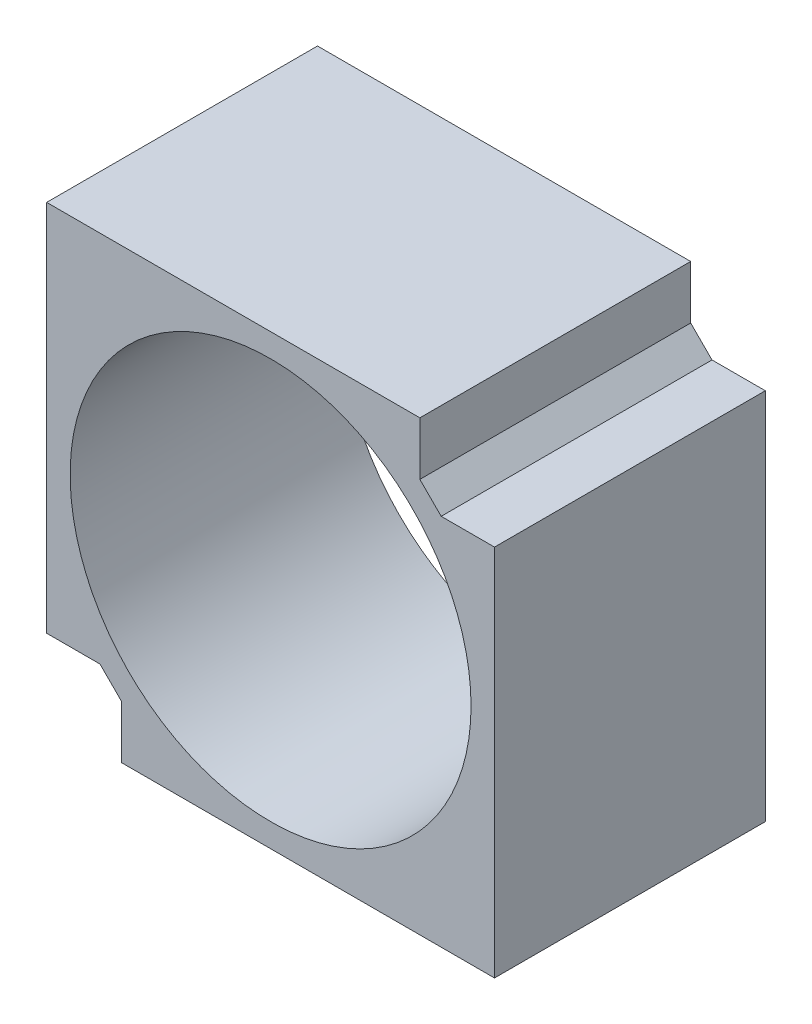
ISO-10303-21;
HEADER;
FILE_DESCRIPTION(('STEP AP214'),'2;1');
FILE_NAME('part.step','',(''),(''),'','','');
FILE_SCHEMA(('AUTOMOTIVE_DESIGN { 1 0 10303 214 1 1 1 1 }'));
ENDSEC;
DATA;
#1=APPLICATION_CONTEXT('core data for automotive mechanical design processes');
#2=APPLICATION_PROTOCOL_DEFINITION('international standard','automotive_design',2000,#1);
#3=PRODUCT_CONTEXT('',#1,'mechanical');
#4=PRODUCT('Part','Part','',(#3));
#5=PRODUCT_RELATED_PRODUCT_CATEGORY('part','',(#4));
#6=PRODUCT_DEFINITION_FORMATION('','',#4);
#7=PRODUCT_DEFINITION_CONTEXT('part definition',#1,'design');
#8=PRODUCT_DEFINITION('design','',#6,#7);
#9=PRODUCT_DEFINITION_SHAPE('','',#8);
#10=(LENGTH_UNIT() NAMED_UNIT(*) SI_UNIT(.MILLI.,.METRE.));
#11=(NAMED_UNIT(*) PLANE_ANGLE_UNIT() SI_UNIT($,.RADIAN.));
#12=(NAMED_UNIT(*) SI_UNIT($,.STERADIAN.) SOLID_ANGLE_UNIT());
#13=UNCERTAINTY_MEASURE_WITH_UNIT(LENGTH_MEASURE(1.E-05),#10,'distance_accuracy_value','');
#14=(GEOMETRIC_REPRESENTATION_CONTEXT(3) GLOBAL_UNCERTAINTY_ASSIGNED_CONTEXT((#13)) GLOBAL_UNIT_ASSIGNED_CONTEXT((#10,
#11,#12)) REPRESENTATION_CONTEXT('',''));
#15=CARTESIAN_POINT('',(0.,0.,0.));
#16=DIRECTION('',(0.,0.,1.));
#17=DIRECTION('',(1.,0.,0.));
#18=AXIS2_PLACEMENT_3D('',#15,#16,#17);
#19=CARTESIAN_POINT('',(-21.,-21.,25.4));
#20=DIRECTION('',(1.,0.,0.));
#21=DIRECTION('',(0.,0.,-1.));
#22=AXIS2_PLACEMENT_3D('',#19,#20,#21);
#23=PLANE('',#22);
#24=DIRECTION('',(0.,-1.,0.));
#25=VECTOR('',#24,1.);
#26=CARTESIAN_POINT('',(-21.,-21.,0.));
#27=LINE('',#26,#25);
#28=CARTESIAN_POINT('',(-21.,21.,0.));
#29=VERTEX_POINT('',#28);
#30=CARTESIAN_POINT('',(-21.,-14.,0.));
#31=VERTEX_POINT('',#30);
#32=EDGE_CURVE('E143',#29,#31,#27,.T.);
#33=ORIENTED_EDGE('',*,*,#32,.T.);
#34=DIRECTION('',(0.,0.,1.));
#35=VECTOR('',#34,1.);
#36=CARTESIAN_POINT('',(-21.,-14.,0.));
#37=LINE('',#36,#35);
#38=CARTESIAN_POINT('',(-21.,-14.,25.4));
#39=VERTEX_POINT('',#38);
#40=EDGE_CURVE('E198',#31,#39,#37,.T.);
#41=ORIENTED_EDGE('',*,*,#40,.T.);
#42=DIRECTION('',(0.,-1.,0.));
#43=VECTOR('',#42,1.);
#44=CARTESIAN_POINT('',(-21.,-21.,25.4));
#45=LINE('',#44,#43);
#46=CARTESIAN_POINT('',(-21.,21.,25.4));
#47=VERTEX_POINT('',#46);
#48=EDGE_CURVE('E165',#47,#39,#45,.T.);
#49=ORIENTED_EDGE('',*,*,#48,.F.);
#50=DIRECTION('',(0.,0.,-1.));
#51=VECTOR('',#50,1.);
#52=CARTESIAN_POINT('',(-21.,21.,25.4));
#53=LINE('',#52,#51);
#54=EDGE_CURVE('E11',#47,#29,#53,.T.);
#55=ORIENTED_EDGE('',*,*,#54,.T.);
#56=EDGE_LOOP('',(#33,#41,#49,#55));
#57=FACE_BOUND('',#56,.T.);
#58=ADVANCED_FACE('F38',(#57),#23,.F.);
#59=CARTESIAN_POINT('',(21.,-21.,25.4));
#60=DIRECTION('',(0.,1.,0.));
#61=DIRECTION('',(-1.,0.,0.));
#62=AXIS2_PLACEMENT_3D('',#59,#60,#61);
#63=PLANE('',#62);
#64=DIRECTION('',(1.,0.,0.));
#65=VECTOR('',#64,1.);
#66=CARTESIAN_POINT('',(21.,-21.,25.4));
#67=LINE('',#66,#65);
#68=CARTESIAN_POINT('',(-14.,-21.,25.4));
#69=VERTEX_POINT('',#68);
#70=CARTESIAN_POINT('',(21.,-21.,25.4));
#71=VERTEX_POINT('',#70);
#72=EDGE_CURVE('E132',#69,#71,#67,.T.);
#73=ORIENTED_EDGE('',*,*,#72,.F.);
#74=DIRECTION('',(0.,0.,1.));
#75=VECTOR('',#74,1.);
#76=CARTESIAN_POINT('',(-14.,-21.,0.));
#77=LINE('',#76,#75);
#78=CARTESIAN_POINT('',(-14.,-21.,0.));
#79=VERTEX_POINT('',#78);
#80=EDGE_CURVE('E118',#79,#69,#77,.T.);
#81=ORIENTED_EDGE('',*,*,#80,.F.);
#82=DIRECTION('',(1.,0.,0.));
#83=VECTOR('',#82,1.);
#84=CARTESIAN_POINT('',(21.,-21.,0.));
#85=LINE('',#84,#83);
#86=CARTESIAN_POINT('',(21.,-21.,0.));
#87=VERTEX_POINT('',#86);
#88=EDGE_CURVE('E130',#79,#87,#85,.T.);
#89=ORIENTED_EDGE('',*,*,#88,.T.);
#90=DIRECTION('',(0.,0.,-1.));
#91=VECTOR('',#90,1.);
#92=CARTESIAN_POINT('',(21.,-21.,25.4));
#93=LINE('',#92,#91);
#94=EDGE_CURVE('E46',#71,#87,#93,.T.);
#95=ORIENTED_EDGE('',*,*,#94,.F.);
#96=EDGE_LOOP('',(#73,#81,#89,#95));
#97=FACE_BOUND('',#96,.T.);
#98=ADVANCED_FACE('F128',(#97),#63,.F.);
#99=CARTESIAN_POINT('',(21.,21.,25.4));
#100=DIRECTION('',(-1.,0.,0.));
#101=DIRECTION('',(0.,-1.,0.));
#102=AXIS2_PLACEMENT_3D('',#99,#100,#101);
#103=PLANE('',#102);
#104=DIRECTION('',(0.,1.,0.));
#105=VECTOR('',#104,1.);
#106=CARTESIAN_POINT('',(21.,21.,0.));
#107=LINE('',#106,#105);
#108=CARTESIAN_POINT('',(21.,14.,0.));
#109=VERTEX_POINT('',#108);
#110=EDGE_CURVE('E141',#87,#109,#107,.T.);
#111=ORIENTED_EDGE('',*,*,#110,.T.);
#112=DIRECTION('',(0.,0.,1.));
#113=VECTOR('',#112,1.);
#114=CARTESIAN_POINT('',(21.,14.,0.));
#115=LINE('',#114,#113);
#116=CARTESIAN_POINT('',(21.,14.,25.4));
#117=VERTEX_POINT('',#116);
#118=EDGE_CURVE('E150',#109,#117,#115,.T.);
#119=ORIENTED_EDGE('',*,*,#118,.T.);
#120=DIRECTION('',(0.,1.,0.));
#121=VECTOR('',#120,1.);
#122=CARTESIAN_POINT('',(21.,21.,25.4));
#123=LINE('',#122,#121);
#124=EDGE_CURVE('E157',#71,#117,#123,.T.);
#125=ORIENTED_EDGE('',*,*,#124,.F.);
#126=ORIENTED_EDGE('',*,*,#94,.T.);
#127=EDGE_LOOP('',(#111,#119,#125,#126));
#128=FACE_BOUND('',#127,.T.);
#129=ADVANCED_FACE('F262',(#128),#103,.F.);
#130=CARTESIAN_POINT('',(0.,21.,25.4));
#131=DIRECTION('',(0.,-1.,0.));
#132=DIRECTION('',(0.,0.,-1.));
#133=AXIS2_PLACEMENT_3D('',#130,#131,#132);
#134=PLANE('',#133);
#135=DIRECTION('',(-1.,0.,0.));
#136=VECTOR('',#135,1.);
#137=CARTESIAN_POINT('',(-21.,21.,25.4));
#138=LINE('',#137,#136);
#139=CARTESIAN_POINT('',(14.,21.,25.4));
#140=VERTEX_POINT('',#139);
#141=EDGE_CURVE('E155',#140,#47,#138,.T.);
#142=ORIENTED_EDGE('',*,*,#141,.F.);
#143=DIRECTION('',(0.,0.,1.));
#144=VECTOR('',#143,1.);
#145=CARTESIAN_POINT('',(14.,21.,0.));
#146=LINE('',#145,#144);
#147=CARTESIAN_POINT('',(14.,21.,0.));
#148=VERTEX_POINT('',#147);
#149=EDGE_CURVE('E173',#148,#140,#146,.T.);
#150=ORIENTED_EDGE('',*,*,#149,.F.);
#151=DIRECTION('',(-1.,0.,0.));
#152=VECTOR('',#151,1.);
#153=CARTESIAN_POINT('',(0.,21.,0.));
#154=LINE('',#153,#152);
#155=EDGE_CURVE('E147',#148,#29,#154,.T.);
#156=ORIENTED_EDGE('',*,*,#155,.T.);
#157=ORIENTED_EDGE('',*,*,#54,.F.);
#158=EDGE_LOOP('',(#142,#150,#156,#157));
#159=FACE_BOUND('',#158,.T.);
#160=ADVANCED_FACE('F245',(#159),#134,.F.);
#161=CARTESIAN_POINT('',(0.,0.,25.4));
#162=DIRECTION('',(0.,0.,-1.));
#163=DIRECTION('',(-1.,0.,0.));
#164=AXIS2_PLACEMENT_3D('',#161,#162,#163);
#165=PLANE('',#164);
#166=CARTESIAN_POINT('',(0.,0.,25.4));
#167=DIRECTION('',(0.,0.,1.));
#168=DIRECTION('',(1.,0.,0.));
#169=AXIS2_PLACEMENT_3D('',#166,#167,#168);
#170=CIRCLE('',#169,18.8);
#171=CARTESIAN_POINT('',(18.8,0.,25.4));
#172=VERTEX_POINT('',#171);
#173=EDGE_CURVE('E228',#172,#172,#170,.T.);
#174=ORIENTED_EDGE('',*,*,#173,.F.);
#175=EDGE_LOOP('',(#174));
#176=FACE_BOUND('',#175,.T.);
#177=ORIENTED_EDGE('',*,*,#48,.T.);
#178=DIRECTION('',(-1.,0.,0.));
#179=VECTOR('',#178,1.);
#180=CARTESIAN_POINT('',(-16.,-14.,25.4));
#181=LINE('',#180,#179);
#182=CARTESIAN_POINT('',(-16.,-14.,25.4));
#183=VERTEX_POINT('',#182);
#184=EDGE_CURVE('E124',#183,#39,#181,.T.);
#185=ORIENTED_EDGE('',*,*,#184,.F.);
#186=DIRECTION('',(-0.707106781186548,0.707106781186547,0.));
#187=VECTOR('',#186,1.);
#188=CARTESIAN_POINT('',(-14.,-16.,25.4));
#189=LINE('',#188,#187);
#190=CARTESIAN_POINT('',(-14.,-16.,25.4));
#191=VERTEX_POINT('',#190);
#192=EDGE_CURVE('E216',#191,#183,#189,.T.);
#193=ORIENTED_EDGE('',*,*,#192,.F.);
#194=DIRECTION('',(0.,1.,0.));
#195=VECTOR('',#194,1.);
#196=CARTESIAN_POINT('',(-14.,-21.,25.4));
#197=LINE('',#196,#195);
#198=EDGE_CURVE('E220',#69,#191,#197,.T.);
#199=ORIENTED_EDGE('',*,*,#198,.F.);
#200=ORIENTED_EDGE('',*,*,#72,.T.);
#201=ORIENTED_EDGE('',*,*,#124,.T.);
#202=DIRECTION('',(1.,0.,0.));
#203=VECTOR('',#202,1.);
#204=CARTESIAN_POINT('',(21.,14.,25.4));
#205=LINE('',#204,#203);
#206=CARTESIAN_POINT('',(16.,14.,25.4));
#207=VERTEX_POINT('',#206);
#208=EDGE_CURVE('E186',#207,#117,#205,.T.);
#209=ORIENTED_EDGE('',*,*,#208,.F.);
#210=DIRECTION('',(0.707106781186548,-0.707106781186548,0.));
#211=VECTOR('',#210,1.);
#212=CARTESIAN_POINT('',(16.,14.,25.4));
#213=LINE('',#212,#211);
#214=CARTESIAN_POINT('',(14.,16.,25.4));
#215=VERTEX_POINT('',#214);
#216=EDGE_CURVE('E190',#215,#207,#213,.T.);
#217=ORIENTED_EDGE('',*,*,#216,.F.);
#218=DIRECTION('',(0.,-1.,0.));
#219=VECTOR('',#218,1.);
#220=CARTESIAN_POINT('',(14.,16.,25.4));
#221=LINE('',#220,#219);
#222=EDGE_CURVE('E194',#140,#215,#221,.T.);
#223=ORIENTED_EDGE('',*,*,#222,.F.);
#224=ORIENTED_EDGE('',*,*,#141,.T.);
#225=EDGE_LOOP('',(#177,#185,#193,#199,#200,#201,#209,#217,#223,#224));
#226=FACE_BOUND('',#225,.T.);
#227=ADVANCED_FACE('F243',(#176,#226),#165,.F.);
#228=CARTESIAN_POINT('',(0.,0.,0.));
#229=DIRECTION('',(0.,0.,-1.));
#230=DIRECTION('',(-1.,0.,0.));
#231=AXIS2_PLACEMENT_3D('',#228,#229,#230);
#232=PLANE('',#231);
#233=CARTESIAN_POINT('',(0.,0.,0.));
#234=DIRECTION('',(0.,0.,1.));
#235=DIRECTION('',(1.,0.,0.));
#236=AXIS2_PLACEMENT_3D('',#233,#234,#235);
#237=CIRCLE('',#236,18.8);
#238=CARTESIAN_POINT('',(18.8,0.,0.));
#239=VERTEX_POINT('',#238);
#240=EDGE_CURVE('E223',#239,#239,#237,.T.);
#241=ORIENTED_EDGE('',*,*,#240,.T.);
#242=EDGE_LOOP('',(#241));
#243=FACE_BOUND('',#242,.T.);
#244=DIRECTION('',(-1.,0.,0.));
#245=VECTOR('',#244,1.);
#246=CARTESIAN_POINT('',(-16.,-14.,0.));
#247=LINE('',#246,#245);
#248=CARTESIAN_POINT('',(-16.,-14.,0.));
#249=VERTEX_POINT('',#248);
#250=EDGE_CURVE('E134',#249,#31,#247,.T.);
#251=ORIENTED_EDGE('',*,*,#250,.T.);
#252=ORIENTED_EDGE('',*,*,#32,.F.);
#253=ORIENTED_EDGE('',*,*,#155,.F.);
#254=DIRECTION('',(0.,-1.,0.));
#255=VECTOR('',#254,1.);
#256=CARTESIAN_POINT('',(14.,16.,0.));
#257=LINE('',#256,#255);
#258=CARTESIAN_POINT('',(14.,16.,0.));
#259=VERTEX_POINT('',#258);
#260=EDGE_CURVE('E189',#148,#259,#257,.T.);
#261=ORIENTED_EDGE('',*,*,#260,.T.);
#262=DIRECTION('',(0.707106781186548,-0.707106781186548,0.));
#263=VECTOR('',#262,1.);
#264=CARTESIAN_POINT('',(16.,14.,0.));
#265=LINE('',#264,#263);
#266=CARTESIAN_POINT('',(16.,14.,0.));
#267=VERTEX_POINT('',#266);
#268=EDGE_CURVE('E61',#259,#267,#265,.T.);
#269=ORIENTED_EDGE('',*,*,#268,.T.);
#270=DIRECTION('',(1.,0.,0.));
#271=VECTOR('',#270,1.);
#272=CARTESIAN_POINT('',(21.,14.,0.));
#273=LINE('',#272,#271);
#274=EDGE_CURVE('E177',#267,#109,#273,.T.);
#275=ORIENTED_EDGE('',*,*,#274,.T.);
#276=ORIENTED_EDGE('',*,*,#110,.F.);
#277=ORIENTED_EDGE('',*,*,#88,.F.);
#278=DIRECTION('',(0.,1.,0.));
#279=VECTOR('',#278,1.);
#280=CARTESIAN_POINT('',(-14.,-21.,0.));
#281=LINE('',#280,#279);
#282=CARTESIAN_POINT('',(-14.,-16.,0.));
#283=VERTEX_POINT('',#282);
#284=EDGE_CURVE('E114',#79,#283,#281,.T.);
#285=ORIENTED_EDGE('',*,*,#284,.T.);
#286=DIRECTION('',(-0.707106781186548,0.707106781186547,0.));
#287=VECTOR('',#286,1.);
#288=CARTESIAN_POINT('',(-14.,-16.,0.));
#289=LINE('',#288,#287);
#290=EDGE_CURVE('E53',#283,#249,#289,.T.);
#291=ORIENTED_EDGE('',*,*,#290,.T.);
#292=EDGE_LOOP('',(#251,#252,#253,#261,#269,#275,#276,#277,#285,#291));
#293=FACE_BOUND('',#292,.T.);
#294=ADVANCED_FACE('F138',(#243,#293),#232,.T.);
#295=CARTESIAN_POINT('',(21.,14.,0.));
#296=DIRECTION('',(0.,-1.,0.));
#297=DIRECTION('',(0.,0.,-1.));
#298=AXIS2_PLACEMENT_3D('',#295,#296,#297);
#299=PLANE('',#298);
#300=ORIENTED_EDGE('',*,*,#208,.T.);
#301=ORIENTED_EDGE('',*,*,#118,.F.);
#302=ORIENTED_EDGE('',*,*,#274,.F.);
#303=DIRECTION('',(0.,0.,1.));
#304=VECTOR('',#303,1.);
#305=CARTESIAN_POINT('',(16.,14.,0.));
#306=LINE('',#305,#304);
#307=EDGE_CURVE('E180',#267,#207,#306,.T.);
#308=ORIENTED_EDGE('',*,*,#307,.T.);
#309=EDGE_LOOP('',(#300,#301,#302,#308));
#310=FACE_BOUND('',#309,.T.);
#311=ADVANCED_FACE('F265',(#310),#299,.F.);
#312=CARTESIAN_POINT('',(16.,14.,0.));
#313=DIRECTION('',(-0.707106781186548,-0.707106781186548,0.));
#314=DIRECTION('',(0.707106781186548,-0.707106781186548,0.));
#315=AXIS2_PLACEMENT_3D('',#312,#313,#314);
#316=PLANE('',#315);
#317=ORIENTED_EDGE('',*,*,#216,.T.);
#318=ORIENTED_EDGE('',*,*,#307,.F.);
#319=ORIENTED_EDGE('',*,*,#268,.F.);
#320=DIRECTION('',(0.,0.,1.));
#321=VECTOR('',#320,1.);
#322=CARTESIAN_POINT('',(14.,16.,0.));
#323=LINE('',#322,#321);
#324=EDGE_CURVE('E176',#259,#215,#323,.T.);
#325=ORIENTED_EDGE('',*,*,#324,.T.);
#326=EDGE_LOOP('',(#317,#318,#319,#325));
#327=FACE_BOUND('',#326,.T.);
#328=ADVANCED_FACE('F269',(#327),#316,.F.);
#329=CARTESIAN_POINT('',(14.,16.,0.));
#330=DIRECTION('',(-1.,0.,0.));
#331=DIRECTION('',(0.,-1.,0.));
#332=AXIS2_PLACEMENT_3D('',#329,#330,#331);
#333=PLANE('',#332);
#334=ORIENTED_EDGE('',*,*,#222,.T.);
#335=ORIENTED_EDGE('',*,*,#324,.F.);
#336=ORIENTED_EDGE('',*,*,#260,.F.);
#337=ORIENTED_EDGE('',*,*,#149,.T.);
#338=EDGE_LOOP('',(#334,#335,#336,#337));
#339=FACE_BOUND('',#338,.T.);
#340=ADVANCED_FACE('F267',(#339),#333,.F.);
#341=CARTESIAN_POINT('',(-16.,-14.,0.));
#342=DIRECTION('',(0.,1.,0.));
#343=DIRECTION('',(-1.,0.,0.));
#344=AXIS2_PLACEMENT_3D('',#341,#342,#343);
#345=PLANE('',#344);
#346=ORIENTED_EDGE('',*,*,#184,.T.);
#347=ORIENTED_EDGE('',*,*,#40,.F.);
#348=ORIENTED_EDGE('',*,*,#250,.F.);
#349=DIRECTION('',(0.,0.,1.));
#350=VECTOR('',#349,1.);
#351=CARTESIAN_POINT('',(-16.,-14.,0.));
#352=LINE('',#351,#350);
#353=EDGE_CURVE('E208',#249,#183,#352,.T.);
#354=ORIENTED_EDGE('',*,*,#353,.T.);
#355=EDGE_LOOP('',(#346,#347,#348,#354));
#356=FACE_BOUND('',#355,.T.);
#357=ADVANCED_FACE('F260',(#356),#345,.F.);
#358=CARTESIAN_POINT('',(-14.,-16.,0.));
#359=DIRECTION('',(0.707106781186547,0.707106781186548,0.));
#360=DIRECTION('',(-0.707106781186548,0.707106781186547,0.));
#361=AXIS2_PLACEMENT_3D('',#358,#359,#360);
#362=PLANE('',#361);
#363=ORIENTED_EDGE('',*,*,#192,.T.);
#364=ORIENTED_EDGE('',*,*,#353,.F.);
#365=ORIENTED_EDGE('',*,*,#290,.F.);
#366=DIRECTION('',(0.,0.,1.));
#367=VECTOR('',#366,1.);
#368=CARTESIAN_POINT('',(-14.,-16.,0.));
#369=LINE('',#368,#367);
#370=EDGE_CURVE('E120',#283,#191,#369,.T.);
#371=ORIENTED_EDGE('',*,*,#370,.T.);
#372=EDGE_LOOP('',(#363,#364,#365,#371));
#373=FACE_BOUND('',#372,.T.);
#374=ADVANCED_FACE('F261',(#373),#362,.F.);
#375=CARTESIAN_POINT('',(-14.,-21.,0.));
#376=DIRECTION('',(1.,0.,0.));
#377=DIRECTION('',(0.,0.,-1.));
#378=AXIS2_PLACEMENT_3D('',#375,#376,#377);
#379=PLANE('',#378);
#380=ORIENTED_EDGE('',*,*,#198,.T.);
#381=ORIENTED_EDGE('',*,*,#370,.F.);
#382=ORIENTED_EDGE('',*,*,#284,.F.);
#383=ORIENTED_EDGE('',*,*,#80,.T.);
#384=EDGE_LOOP('',(#380,#381,#382,#383));
#385=FACE_BOUND('',#384,.T.);
#386=ADVANCED_FACE('F117',(#385),#379,.F.);
#387=CARTESIAN_POINT('',(0.,0.,0.));
#388=DIRECTION('',(0.,0.,1.));
#389=DIRECTION('',(1.,0.,0.));
#390=AXIS2_PLACEMENT_3D('',#387,#388,#389);
#391=CYLINDRICAL_SURFACE('',#390,18.8);
#392=ORIENTED_EDGE('',*,*,#240,.F.);
#393=EDGE_LOOP('',(#392));
#394=FACE_BOUND('',#393,.T.);
#395=ORIENTED_EDGE('',*,*,#173,.T.);
#396=EDGE_LOOP('',(#395));
#397=FACE_BOUND('',#396,.T.);
#398=ADVANCED_FACE('F237',(#394,#397),#391,.F.);
#399=CLOSED_SHELL('',(#58,#98,#129,#160,#227,#294,#311,#328,#340,#357,#374,#386,#398));
#400=MANIFOLD_SOLID_BREP('B2',#399);
#401=ADVANCED_BREP_SHAPE_REPRESENTATION('',(#18,#400),#14);
#402=SHAPE_DEFINITION_REPRESENTATION(#9,#401);
ENDSEC;
END-ISO-10303-21;
